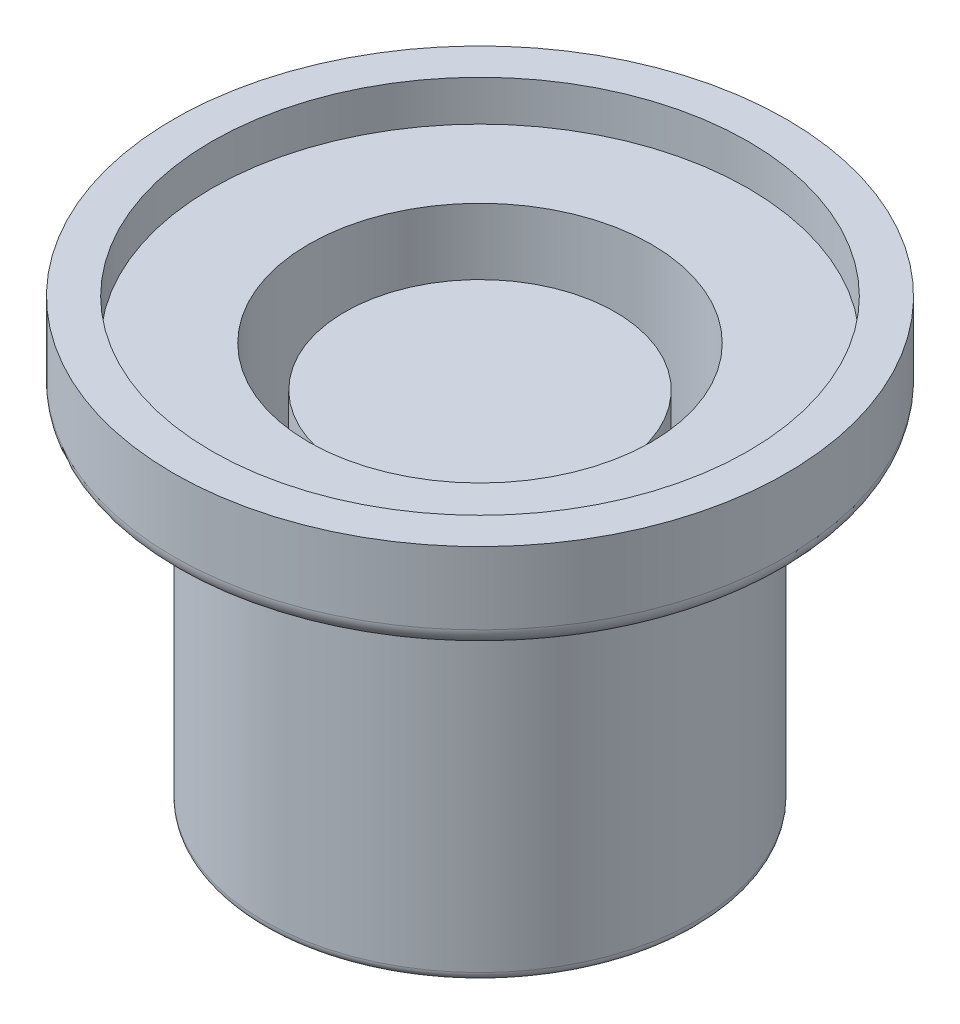
ISO-10303-21;
HEADER;
FILE_DESCRIPTION(('STEP AP214'),'2;1');
FILE_NAME('part.step','',(''),(''),'','','');
FILE_SCHEMA(('AUTOMOTIVE_DESIGN { 1 0 10303 214 1 1 1 1 }'));
ENDSEC;
DATA;
#1=APPLICATION_CONTEXT('core data for automotive mechanical design processes');
#2=APPLICATION_PROTOCOL_DEFINITION('international standard','automotive_design',2000,#1);
#3=PRODUCT_CONTEXT('',#1,'mechanical');
#4=PRODUCT('Part','Part','',(#3));
#5=PRODUCT_RELATED_PRODUCT_CATEGORY('part','',(#4));
#6=PRODUCT_DEFINITION_FORMATION('','',#4);
#7=PRODUCT_DEFINITION_CONTEXT('part definition',#1,'design');
#8=PRODUCT_DEFINITION('design','',#6,#7);
#9=PRODUCT_DEFINITION_SHAPE('','',#8);
#10=(LENGTH_UNIT() NAMED_UNIT(*) SI_UNIT(.MILLI.,.METRE.));
#11=(NAMED_UNIT(*) PLANE_ANGLE_UNIT() SI_UNIT($,.RADIAN.));
#12=(NAMED_UNIT(*) SI_UNIT($,.STERADIAN.) SOLID_ANGLE_UNIT());
#13=UNCERTAINTY_MEASURE_WITH_UNIT(LENGTH_MEASURE(1.E-05),#10,'distance_accuracy_value','');
#14=(GEOMETRIC_REPRESENTATION_CONTEXT(3) GLOBAL_UNCERTAINTY_ASSIGNED_CONTEXT((#13)) GLOBAL_UNIT_ASSIGNED_CONTEXT((#10,
#11,#12)) REPRESENTATION_CONTEXT('',''));
#15=CARTESIAN_POINT('',(0.,0.,0.));
#16=DIRECTION('',(0.,0.,1.));
#17=DIRECTION('',(1.,0.,0.));
#18=AXIS2_PLACEMENT_3D('',#15,#16,#17);
#19=CARTESIAN_POINT('',(0.,3.4,29.325));
#20=DIRECTION('',(0.,1.,0.));
#21=DIRECTION('',(0.,0.,1.));
#22=AXIS2_PLACEMENT_3D('',#19,#20,#21);
#23=PLANE('',#22);
#24=CARTESIAN_POINT('',(0.,3.4,29.325));
#25=DIRECTION('',(0.,1.,0.));
#26=DIRECTION('',(0.,0.,1.));
#27=AXIS2_PLACEMENT_3D('',#24,#25,#26);
#28=CIRCLE('',#27,2.97487373415292);
#29=CARTESIAN_POINT('',(0.,3.4,32.2998737341529));
#30=VERTEX_POINT('',#29);
#31=EDGE_CURVE('E103',#30,#30,#28,.T.);
#32=ORIENTED_EDGE('',*,*,#31,.F.);
#33=EDGE_LOOP('',(#32));
#34=FACE_BOUND('',#33,.T.);
#35=CARTESIAN_POINT('',(0.,3.4,29.325));
#36=DIRECTION('',(0.,1.,0.));
#37=DIRECTION('',(0.,0.,1.));
#38=AXIS2_PLACEMENT_3D('',#35,#36,#37);
#39=CIRCLE('',#38,3.4);
#40=CARTESIAN_POINT('',(0.,3.4,32.725));
#41=VERTEX_POINT('',#40);
#42=EDGE_CURVE('E84',#41,#41,#39,.T.);
#43=ORIENTED_EDGE('',*,*,#42,.T.);
#44=EDGE_LOOP('',(#43));
#45=FACE_BOUND('',#44,.T.);
#46=ADVANCED_FACE('F58',(#34,#45),#23,.T.);
#47=CARTESIAN_POINT('',(0.,-1.49850203850974,29.325));
#48=DIRECTION('',(0.,-1.,0.));
#49=DIRECTION('',(0.,0.,-1.));
#50=AXIS2_PLACEMENT_3D('',#47,#48,#49);
#51=PLANE('',#50);
#52=CARTESIAN_POINT('',(0.,-1.49850203850974,29.325));
#53=DIRECTION('',(0.,-1.,0.));
#54=DIRECTION('',(0.,0.,-1.));
#55=AXIS2_PLACEMENT_3D('',#52,#53,#54);
#56=CIRCLE('',#55,2.3);
#57=CARTESIAN_POINT('',(0.,-1.49850203850974,27.025));
#58=VERTEX_POINT('',#57);
#59=EDGE_CURVE('E79',#58,#58,#56,.T.);
#60=ORIENTED_EDGE('',*,*,#59,.T.);
#61=EDGE_LOOP('',(#60));
#62=FACE_BOUND('',#61,.T.);
#63=ADVANCED_FACE('F135',(#62),#51,.T.);
#64=CARTESIAN_POINT('',(0.,13.866652224137,29.325));
#65=DIRECTION('',(0.,-1.,0.));
#66=DIRECTION('',(0.,0.,-1.));
#67=AXIS2_PLACEMENT_3D('',#64,#65,#66);
#68=CYLINDRICAL_SURFACE('',#67,2.4);
#69=CARTESIAN_POINT('',(0.,-1.39850203850974,29.325));
#70=DIRECTION('',(0.,-1.,0.));
#71=DIRECTION('',(0.,0.,-1.));
#72=AXIS2_PLACEMENT_3D('',#69,#70,#71);
#73=CIRCLE('',#72,2.4);
#74=CARTESIAN_POINT('',(0.,-1.39850203850974,26.925));
#75=VERTEX_POINT('',#74);
#76=EDGE_CURVE('E73',#75,#75,#73,.F.);
#77=ORIENTED_EDGE('',*,*,#76,.T.);
#78=EDGE_LOOP('',(#77));
#79=FACE_BOUND('',#78,.T.);
#80=CARTESIAN_POINT('',(0.,2.4,29.325));
#81=DIRECTION('',(0.,1.,0.));
#82=DIRECTION('',(0.,0.,1.));
#83=AXIS2_PLACEMENT_3D('',#80,#81,#82);
#84=CIRCLE('',#83,2.4);
#85=CARTESIAN_POINT('',(0.,2.4,31.725));
#86=VERTEX_POINT('',#85);
#87=EDGE_CURVE('E83',#86,#86,#84,.F.);
#88=ORIENTED_EDGE('',*,*,#87,.T.);
#89=EDGE_LOOP('',(#88));
#90=FACE_BOUND('',#89,.T.);
#91=ADVANCED_FACE('F141',(#79,#90),#68,.T.);
#92=CARTESIAN_POINT('',(0.,2.4,0.));
#93=DIRECTION('',(0.,1.,0.));
#94=DIRECTION('',(0.,0.,1.));
#95=AXIS2_PLACEMENT_3D('',#92,#93,#94);
#96=PLANE('',#95);
#97=CARTESIAN_POINT('',(0.,2.4,29.325));
#98=DIRECTION('',(0.,1.,0.));
#99=DIRECTION('',(0.,0.,1.));
#100=AXIS2_PLACEMENT_3D('',#97,#98,#99);
#101=CIRCLE('',#100,3.2);
#102=CARTESIAN_POINT('',(0.,2.4,32.525));
#103=VERTEX_POINT('',#102);
#104=EDGE_CURVE('E13',#103,#103,#101,.F.);
#105=ORIENTED_EDGE('',*,*,#104,.T.);
#106=EDGE_LOOP('',(#105));
#107=FACE_BOUND('',#106,.T.);
#108=ORIENTED_EDGE('',*,*,#87,.F.);
#109=EDGE_LOOP('',(#108));
#110=FACE_BOUND('',#109,.T.);
#111=ADVANCED_FACE('F158',(#107,#110),#96,.F.);
#112=CARTESIAN_POINT('',(0.,13.866652224137,29.325));
#113=DIRECTION('',(0.,-1.,0.));
#114=DIRECTION('',(0.,0.,-1.));
#115=AXIS2_PLACEMENT_3D('',#112,#113,#114);
#116=CYLINDRICAL_SURFACE('',#115,3.4);
#117=CARTESIAN_POINT('',(0.,2.6,29.325));
#118=DIRECTION('',(0.,1.,0.));
#119=DIRECTION('',(0.,0.,1.));
#120=AXIS2_PLACEMENT_3D('',#117,#118,#119);
#121=CIRCLE('',#120,3.4);
#122=CARTESIAN_POINT('',(0.,2.6,32.725));
#123=VERTEX_POINT('',#122);
#124=EDGE_CURVE('E67',#123,#123,#121,.T.);
#125=ORIENTED_EDGE('',*,*,#124,.T.);
#126=EDGE_LOOP('',(#125));
#127=FACE_BOUND('',#126,.T.);
#128=ORIENTED_EDGE('',*,*,#42,.F.);
#129=EDGE_LOOP('',(#128));
#130=FACE_BOUND('',#129,.T.);
#131=ADVANCED_FACE('F151',(#127,#130),#116,.T.);
#132=CARTESIAN_POINT('',(0.,-1.39850203850974,29.325));
#133=DIRECTION('',(0.,-1.,0.));
#134=DIRECTION('',(0.,0.,-1.));
#135=AXIS2_PLACEMENT_3D('',#132,#133,#134);
#136=TOROIDAL_SURFACE('',#135,2.3,0.1);
#137=ORIENTED_EDGE('',*,*,#76,.F.);
#138=EDGE_LOOP('',(#137));
#139=FACE_BOUND('',#138,.T.);
#140=ORIENTED_EDGE('',*,*,#59,.F.);
#141=EDGE_LOOP('',(#140));
#142=FACE_BOUND('',#141,.T.);
#143=ADVANCED_FACE('F149',(#139,#142),#136,.T.);
#144=CARTESIAN_POINT('',(0.,2.6,29.325));
#145=DIRECTION('',(0.,1.,0.));
#146=DIRECTION('',(0.,0.,1.));
#147=AXIS2_PLACEMENT_3D('',#144,#145,#146);
#148=TOROIDAL_SURFACE('',#147,3.2,0.2);
#149=ORIENTED_EDGE('',*,*,#104,.F.);
#150=EDGE_LOOP('',(#149));
#151=FACE_BOUND('',#150,.T.);
#152=ORIENTED_EDGE('',*,*,#124,.F.);
#153=EDGE_LOOP('',(#152));
#154=FACE_BOUND('',#153,.T.);
#155=ADVANCED_FACE('F60',(#151,#154),#148,.T.);
#156=CARTESIAN_POINT('',(0.,2.95,29.325));
#157=DIRECTION('',(0.,1.,0.));
#158=DIRECTION('',(0.,0.,1.));
#159=AXIS2_PLACEMENT_3D('',#156,#157,#158);
#160=PLANE('',#159);
#161=CARTESIAN_POINT('',(0.,2.95,29.325));
#162=DIRECTION('',(0.,1.,0.));
#163=DIRECTION('',(0.,0.,1.));
#164=AXIS2_PLACEMENT_3D('',#161,#162,#163);
#165=CIRCLE('',#164,2.97487373415292);
#166=CARTESIAN_POINT('',(0.,2.95,32.2998737341529));
#167=VERTEX_POINT('',#166);
#168=EDGE_CURVE('E107',#167,#167,#165,.T.);
#169=ORIENTED_EDGE('',*,*,#168,.T.);
#170=EDGE_LOOP('',(#169));
#171=FACE_BOUND('',#170,.T.);
#172=CARTESIAN_POINT('',(0.,2.95,29.325));
#173=DIRECTION('',(0.,1.,0.));
#174=DIRECTION('',(0.,0.,1.));
#175=AXIS2_PLACEMENT_3D('',#172,#173,#174);
#176=CIRCLE('',#175,1.9);
#177=CARTESIAN_POINT('',(0.,2.95,31.225));
#178=VERTEX_POINT('',#177);
#179=EDGE_CURVE('E62',#178,#178,#176,.F.);
#180=ORIENTED_EDGE('',*,*,#179,.T.);
#181=EDGE_LOOP('',(#180));
#182=FACE_BOUND('',#181,.T.);
#183=ADVANCED_FACE('F118',(#171,#182),#160,.T.);
#184=CARTESIAN_POINT('',(0.,2.95,29.325));
#185=DIRECTION('',(0.,1.,0.));
#186=DIRECTION('',(0.,0.,1.));
#187=AXIS2_PLACEMENT_3D('',#184,#185,#186);
#188=CYLINDRICAL_SURFACE('',#187,2.97487373415292);
#189=ORIENTED_EDGE('',*,*,#168,.F.);
#190=EDGE_LOOP('',(#189));
#191=FACE_BOUND('',#190,.T.);
#192=ORIENTED_EDGE('',*,*,#31,.T.);
#193=EDGE_LOOP('',(#192));
#194=FACE_BOUND('',#193,.T.);
#195=ADVANCED_FACE('F178',(#191,#194),#188,.F.);
#196=CARTESIAN_POINT('',(0.,2.5,29.325));
#197=DIRECTION('',(0.,1.,0.));
#198=DIRECTION('',(0.,0.,1.));
#199=AXIS2_PLACEMENT_3D('',#196,#197,#198);
#200=PLANE('',#199);
#201=CARTESIAN_POINT('',(0.,2.5,29.325));
#202=DIRECTION('',(0.,1.,0.));
#203=DIRECTION('',(0.,0.,1.));
#204=AXIS2_PLACEMENT_3D('',#201,#202,#203);
#205=CIRCLE('',#204,1.5);
#206=CARTESIAN_POINT('',(0.,2.5,30.825));
#207=VERTEX_POINT('',#206);
#208=EDGE_CURVE('E88',#207,#207,#205,.F.);
#209=ORIENTED_EDGE('',*,*,#208,.F.);
#210=EDGE_LOOP('',(#209));
#211=FACE_BOUND('',#210,.T.);
#212=ADVANCED_FACE('F147',(#211),#200,.T.);
#213=CARTESIAN_POINT('',(0.,-6.2825135755275,29.325));
#214=DIRECTION('',(0.,1.,0.));
#215=DIRECTION('',(0.,0.,1.));
#216=AXIS2_PLACEMENT_3D('',#213,#214,#215);
#217=CYLINDRICAL_SURFACE('',#216,1.5);
#218=CARTESIAN_POINT('',(0.,-0.158502038509743,29.325));
#219=DIRECTION('',(0.,-1.,0.));
#220=DIRECTION('',(0.,0.,-1.));
#221=AXIS2_PLACEMENT_3D('',#218,#219,#220);
#222=CIRCLE('',#221,1.5);
#223=CARTESIAN_POINT('',(0.,-0.158502038509743,27.825));
#224=VERTEX_POINT('',#223);
#225=EDGE_CURVE('E96',#224,#224,#222,.F.);
#226=ORIENTED_EDGE('',*,*,#225,.T.);
#227=EDGE_LOOP('',(#226));
#228=FACE_BOUND('',#227,.T.);
#229=ORIENTED_EDGE('',*,*,#208,.T.);
#230=EDGE_LOOP('',(#229));
#231=FACE_BOUND('',#230,.T.);
#232=ADVANCED_FACE('F128',(#228,#231),#217,.T.);
#233=CARTESIAN_POINT('',(0.,-0.158502038509743,29.325));
#234=DIRECTION('',(0.,-1.,0.));
#235=DIRECTION('',(0.,0.,-1.));
#236=AXIS2_PLACEMENT_3D('',#233,#234,#235);
#237=PLANE('',#236);
#238=CARTESIAN_POINT('',(0.,-0.158502038509743,29.325));
#239=DIRECTION('',(0.,-1.,0.));
#240=DIRECTION('',(0.,0.,-1.));
#241=AXIS2_PLACEMENT_3D('',#238,#239,#240);
#242=CIRCLE('',#241,1.9);
#243=CARTESIAN_POINT('',(0.,-0.158502038509743,27.425));
#244=VERTEX_POINT('',#243);
#245=EDGE_CURVE('E92',#244,#244,#242,.F.);
#246=ORIENTED_EDGE('',*,*,#245,.T.);
#247=EDGE_LOOP('',(#246));
#248=FACE_BOUND('',#247,.T.);
#249=ORIENTED_EDGE('',*,*,#225,.F.);
#250=EDGE_LOOP('',(#249));
#251=FACE_BOUND('',#250,.T.);
#252=ADVANCED_FACE('F122',(#248,#251),#237,.F.);
#253=CARTESIAN_POINT('',(0.,-6.2825135755275,29.325));
#254=DIRECTION('',(0.,1.,0.));
#255=DIRECTION('',(0.,0.,1.));
#256=AXIS2_PLACEMENT_3D('',#253,#254,#255);
#257=CYLINDRICAL_SURFACE('',#256,1.9);
#258=ORIENTED_EDGE('',*,*,#245,.F.);
#259=EDGE_LOOP('',(#258));
#260=FACE_BOUND('',#259,.T.);
#261=ORIENTED_EDGE('',*,*,#179,.F.);
#262=EDGE_LOOP('',(#261));
#263=FACE_BOUND('',#262,.T.);
#264=ADVANCED_FACE('F120',(#260,#263),#257,.F.);
#265=CLOSED_SHELL('',(#46,#63,#91,#111,#131,#143,#155,#183,#195,#212,#232,#252,#264));
#266=MANIFOLD_SOLID_BREP('B2',#265);
#267=ADVANCED_BREP_SHAPE_REPRESENTATION('',(#18,#266),#14);
#268=SHAPE_DEFINITION_REPRESENTATION(#9,#267);
ENDSEC;
END-ISO-10303-21;
